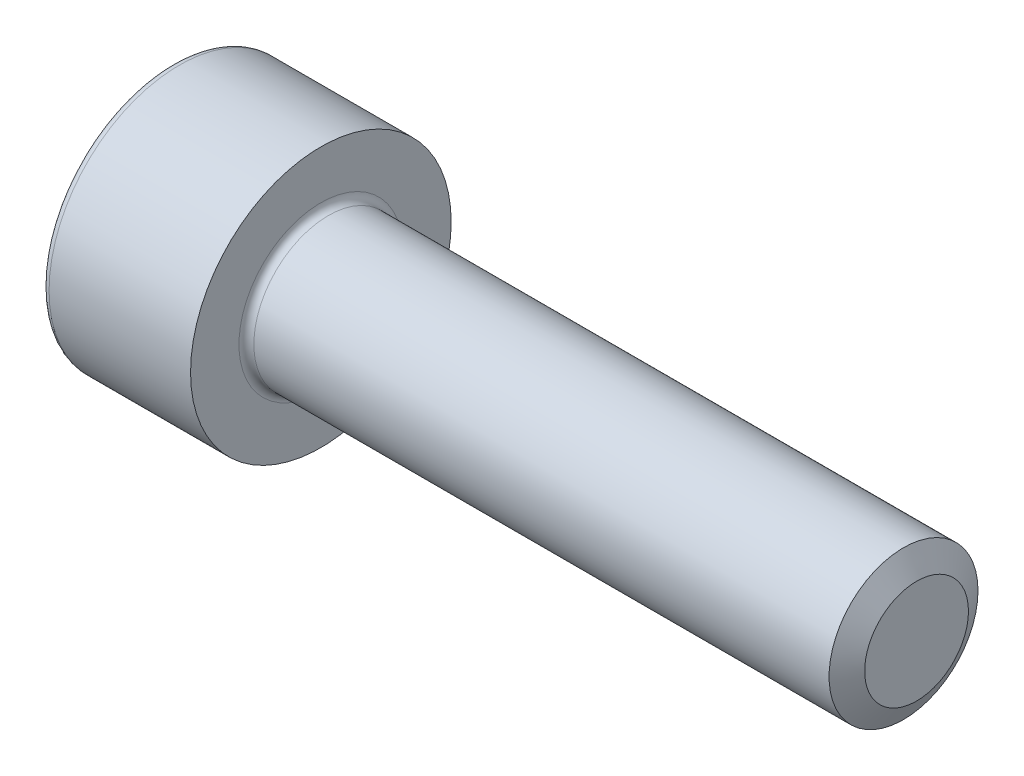
ISO-10303-21;
HEADER;
FILE_DESCRIPTION(('STEP AP214'),'2;1');
FILE_NAME('part.step','',(''),(''),'','','');
FILE_SCHEMA(('AUTOMOTIVE_DESIGN { 1 0 10303 214 1 1 1 1 }'));
ENDSEC;
DATA;
#1=APPLICATION_CONTEXT('core data for automotive mechanical design processes');
#2=APPLICATION_PROTOCOL_DEFINITION('international standard','automotive_design',2000,#1);
#3=PRODUCT_CONTEXT('',#1,'mechanical');
#4=PRODUCT('Part','Part','',(#3));
#5=PRODUCT_RELATED_PRODUCT_CATEGORY('part','',(#4));
#6=PRODUCT_DEFINITION_FORMATION('','',#4);
#7=PRODUCT_DEFINITION_CONTEXT('part definition',#1,'design');
#8=PRODUCT_DEFINITION('design','',#6,#7);
#9=PRODUCT_DEFINITION_SHAPE('','',#8);
#10=(LENGTH_UNIT() NAMED_UNIT(*) SI_UNIT(.MILLI.,.METRE.));
#11=(NAMED_UNIT(*) PLANE_ANGLE_UNIT() SI_UNIT($,.RADIAN.));
#12=(NAMED_UNIT(*) SI_UNIT($,.STERADIAN.) SOLID_ANGLE_UNIT());
#13=UNCERTAINTY_MEASURE_WITH_UNIT(LENGTH_MEASURE(1.E-05),#10,'distance_accuracy_value','');
#14=(GEOMETRIC_REPRESENTATION_CONTEXT(3) GLOBAL_UNCERTAINTY_ASSIGNED_CONTEXT((#13)) GLOBAL_UNIT_ASSIGNED_CONTEXT((#10,
#11,#12)) REPRESENTATION_CONTEXT('',''));
#15=CARTESIAN_POINT('',(0.,0.,0.));
#16=DIRECTION('',(0.,0.,1.));
#17=DIRECTION('',(1.,0.,0.));
#18=AXIS2_PLACEMENT_3D('',#15,#16,#17);
#19=CARTESIAN_POINT('',(0.,0.,0.));
#20=DIRECTION('',(1.,0.,0.));
#21=DIRECTION('',(0.,0.,-1.));
#22=AXIS2_PLACEMENT_3D('',#19,#20,#21);
#23=CYLINDRICAL_SURFACE('',#22,3.5);
#24=CARTESIAN_POINT('',(0.2,0.,0.));
#25=DIRECTION('',(-1.,0.,0.));
#26=DIRECTION('',(0.,0.,1.));
#27=AXIS2_PLACEMENT_3D('',#24,#25,#26);
#28=CIRCLE('',#27,3.5);
#29=CARTESIAN_POINT('',(0.2,0.,3.5));
#30=VERTEX_POINT('',#29);
#31=EDGE_CURVE('E46',#30,#30,#28,.F.);
#32=ORIENTED_EDGE('',*,*,#31,.T.);
#33=EDGE_LOOP('',(#32));
#34=FACE_BOUND('',#33,.T.);
#35=CARTESIAN_POINT('',(4.,0.,0.));
#36=DIRECTION('',(1.,0.,0.));
#37=DIRECTION('',(0.,0.,-1.));
#38=AXIS2_PLACEMENT_3D('',#35,#36,#37);
#39=CIRCLE('',#38,3.5);
#40=CARTESIAN_POINT('',(4.,0.,-3.5));
#41=VERTEX_POINT('',#40);
#42=EDGE_CURVE('E140',#41,#41,#39,.T.);
#43=ORIENTED_EDGE('',*,*,#42,.F.);
#44=EDGE_LOOP('',(#43));
#45=FACE_BOUND('',#44,.T.);
#46=ADVANCED_FACE('F38',(#34,#45),#23,.T.);
#47=CARTESIAN_POINT('',(0.,3.5,0.));
#48=DIRECTION('',(-1.,0.,0.));
#49=DIRECTION('',(0.,0.,1.));
#50=AXIS2_PLACEMENT_3D('',#47,#48,#49);
#51=PLANE('',#50);
#52=CARTESIAN_POINT('',(0.,0.,0.));
#53=DIRECTION('',(-1.,0.,0.));
#54=DIRECTION('',(0.,0.,1.));
#55=AXIS2_PLACEMENT_3D('',#52,#53,#54);
#56=CIRCLE('',#55,3.3);
#57=CARTESIAN_POINT('',(0.,0.,3.3));
#58=VERTEX_POINT('',#57);
#59=EDGE_CURVE('E11',#58,#58,#56,.T.);
#60=ORIENTED_EDGE('',*,*,#59,.T.);
#61=EDGE_LOOP('',(#60));
#62=FACE_BOUND('',#61,.T.);
#63=DIRECTION('',(0.,0.5,-0.866025403784439));
#64=VECTOR('',#63,1.);
#65=CARTESIAN_POINT('',(0.,0.860000000000001,1.48956369450923));
#66=LINE('',#65,#64);
#67=CARTESIAN_POINT('',(0.,0.860000000000001,1.48956369450923));
#68=VERTEX_POINT('',#67);
#69=CARTESIAN_POINT('',(0.,1.72,0.));
#70=VERTEX_POINT('',#69);
#71=EDGE_CURVE('E53',#68,#70,#66,.T.);
#72=ORIENTED_EDGE('',*,*,#71,.F.);
#73=DIRECTION('',(0.,1.,0.));
#74=VECTOR('',#73,1.);
#75=CARTESIAN_POINT('',(0.,-0.86,1.48956369450923));
#76=LINE('',#75,#74);
#77=CARTESIAN_POINT('',(0.,-0.86,1.48956369450923));
#78=VERTEX_POINT('',#77);
#79=EDGE_CURVE('E136',#78,#68,#76,.T.);
#80=ORIENTED_EDGE('',*,*,#79,.F.);
#81=DIRECTION('',(0.,0.5,0.866025403784439));
#82=VECTOR('',#81,1.);
#83=CARTESIAN_POINT('',(0.,-1.72,0.));
#84=LINE('',#83,#82);
#85=CARTESIAN_POINT('',(0.,-1.72,0.));
#86=VERTEX_POINT('',#85);
#87=EDGE_CURVE('E134',#86,#78,#84,.T.);
#88=ORIENTED_EDGE('',*,*,#87,.F.);
#89=DIRECTION('',(0.,-0.5,0.866025403784438));
#90=VECTOR('',#89,1.);
#91=CARTESIAN_POINT('',(0.,-0.86,-1.48956369450923));
#92=LINE('',#91,#90);
#93=CARTESIAN_POINT('',(0.,-0.86,-1.48956369450923));
#94=VERTEX_POINT('',#93);
#95=EDGE_CURVE('E101',#94,#86,#92,.T.);
#96=ORIENTED_EDGE('',*,*,#95,.F.);
#97=DIRECTION('',(0.,-1.,0.));
#98=VECTOR('',#97,1.);
#99=CARTESIAN_POINT('',(0.,0.86,-1.48956369450923));
#100=LINE('',#99,#98);
#101=CARTESIAN_POINT('',(0.,0.86,-1.48956369450923));
#102=VERTEX_POINT('',#101);
#103=EDGE_CURVE('E130',#102,#94,#100,.T.);
#104=ORIENTED_EDGE('',*,*,#103,.F.);
#105=DIRECTION('',(0.,-0.5,-0.866025403784439));
#106=VECTOR('',#105,1.);
#107=CARTESIAN_POINT('',(0.,1.72,0.));
#108=LINE('',#107,#106);
#109=EDGE_CURVE('E127',#70,#102,#108,.T.);
#110=ORIENTED_EDGE('',*,*,#109,.F.);
#111=EDGE_LOOP('',(#72,#80,#88,#96,#104,#110));
#112=FACE_BOUND('',#111,.T.);
#113=ADVANCED_FACE('F174',(#62,#112),#51,.T.);
#114=CARTESIAN_POINT('',(4.,0.,0.));
#115=DIRECTION('',(1.,0.,0.));
#116=DIRECTION('',(0.,0.,-1.));
#117=AXIS2_PLACEMENT_3D('',#114,#115,#116);
#118=PLANE('',#117);
#119=CARTESIAN_POINT('',(4.,0.,0.));
#120=DIRECTION('',(1.,0.,0.));
#121=DIRECTION('',(0.,0.,-1.));
#122=AXIS2_PLACEMENT_3D('',#119,#120,#121);
#123=CIRCLE('',#122,2.2);
#124=CARTESIAN_POINT('',(4.,0.,-2.2));
#125=VERTEX_POINT('',#124);
#126=EDGE_CURVE('E157',#125,#125,#123,.F.);
#127=ORIENTED_EDGE('',*,*,#126,.T.);
#128=EDGE_LOOP('',(#127));
#129=FACE_BOUND('',#128,.T.);
#130=ORIENTED_EDGE('',*,*,#42,.T.);
#131=EDGE_LOOP('',(#130));
#132=FACE_BOUND('',#131,.T.);
#133=ADVANCED_FACE('F179',(#129,#132),#118,.T.);
#134=CARTESIAN_POINT('',(20.,0.,0.));
#135=DIRECTION('',(-1.,0.,0.));
#136=DIRECTION('',(0.,0.,1.));
#137=AXIS2_PLACEMENT_3D('',#134,#135,#136);
#138=CYLINDRICAL_SURFACE('',#137,2.);
#139=CARTESIAN_POINT('',(4.2,0.,0.));
#140=DIRECTION('',(1.,0.,0.));
#141=DIRECTION('',(0.,0.,-1.));
#142=AXIS2_PLACEMENT_3D('',#139,#140,#141);
#143=CIRCLE('',#142,2.);
#144=CARTESIAN_POINT('',(4.2,0.,-2.));
#145=VERTEX_POINT('',#144);
#146=EDGE_CURVE('E154',#145,#145,#143,.T.);
#147=ORIENTED_EDGE('',*,*,#146,.T.);
#148=EDGE_LOOP('',(#147));
#149=FACE_BOUND('',#148,.T.);
#150=CARTESIAN_POINT('',(19.6500000000051,0.,0.));
#151=DIRECTION('',(1.,0.,0.));
#152=DIRECTION('',(0.,0.,-1.));
#153=AXIS2_PLACEMENT_3D('',#150,#151,#152);
#154=CIRCLE('',#153,2.);
#155=CARTESIAN_POINT('',(19.6500000000051,0.,-2.));
#156=VERTEX_POINT('',#155);
#157=EDGE_CURVE('E151',#156,#156,#154,.F.);
#158=ORIENTED_EDGE('',*,*,#157,.T.);
#159=EDGE_LOOP('',(#158));
#160=FACE_BOUND('',#159,.T.);
#161=ADVANCED_FACE('F201',(#149,#160),#138,.T.);
#162=CARTESIAN_POINT('',(20.,0.,0.));
#163=DIRECTION('',(1.,0.,0.));
#164=DIRECTION('',(0.,0.,-1.));
#165=AXIS2_PLACEMENT_3D('',#162,#163,#164);
#166=PLANE('',#165);
#167=CARTESIAN_POINT('',(20.,0.,0.));
#168=DIRECTION('',(1.,0.,0.));
#169=DIRECTION('',(0.,0.,-1.));
#170=AXIS2_PLACEMENT_3D('',#167,#168,#169);
#171=CIRCLE('',#170,1.39380000004541);
#172=CARTESIAN_POINT('',(20.,0.,-1.39380000004541));
#173=VERTEX_POINT('',#172);
#174=EDGE_CURVE('E148',#173,#173,#171,.T.);
#175=ORIENTED_EDGE('',*,*,#174,.T.);
#176=EDGE_LOOP('',(#175));
#177=FACE_BOUND('',#176,.T.);
#178=ADVANCED_FACE('F198',(#177),#166,.T.);
#179=CARTESIAN_POINT('',(2.,0.860000000000001,1.48956369450923));
#180=DIRECTION('',(0.,0.866025403784439,0.5));
#181=DIRECTION('',(0.,-0.5,0.866025403784439));
#182=AXIS2_PLACEMENT_3D('',#179,#180,#181);
#183=PLANE('',#182);
#184=ORIENTED_EDGE('',*,*,#71,.T.);
#185=DIRECTION('',(-1.,0.,0.));
#186=VECTOR('',#185,1.);
#187=CARTESIAN_POINT('',(2.,1.72,0.));
#188=LINE('',#187,#186);
#189=CARTESIAN_POINT('',(2.,1.72,0.));
#190=VERTEX_POINT('',#189);
#191=EDGE_CURVE('E83',#190,#70,#188,.T.);
#192=ORIENTED_EDGE('',*,*,#191,.F.);
#193=DIRECTION('',(0.,0.5,-0.866025403784439));
#194=VECTOR('',#193,1.);
#195=CARTESIAN_POINT('',(2.,0.860000000000001,1.48956369450923));
#196=LINE('',#195,#194);
#197=CARTESIAN_POINT('',(2.,0.860000000000001,1.48956369450923));
#198=VERTEX_POINT('',#197);
#199=EDGE_CURVE('E138',#198,#190,#196,.T.);
#200=ORIENTED_EDGE('',*,*,#199,.F.);
#201=DIRECTION('',(-1.,0.,0.));
#202=VECTOR('',#201,1.);
#203=CARTESIAN_POINT('',(2.,0.860000000000001,1.48956369450923));
#204=LINE('',#203,#202);
#205=EDGE_CURVE('E61',#198,#68,#204,.T.);
#206=ORIENTED_EDGE('',*,*,#205,.T.);
#207=EDGE_LOOP('',(#184,#192,#200,#206));
#208=FACE_BOUND('',#207,.T.);
#209=ADVANCED_FACE('F200',(#208),#183,.F.);
#210=CARTESIAN_POINT('',(2.,-0.86,1.48956369450923));
#211=DIRECTION('',(0.,0.,1.));
#212=DIRECTION('',(0.,-1.,0.));
#213=AXIS2_PLACEMENT_3D('',#210,#211,#212);
#214=PLANE('',#213);
#215=ORIENTED_EDGE('',*,*,#79,.T.);
#216=ORIENTED_EDGE('',*,*,#205,.F.);
#217=DIRECTION('',(0.,1.,0.));
#218=VECTOR('',#217,1.);
#219=CARTESIAN_POINT('',(2.,-0.86,1.48956369450923));
#220=LINE('',#219,#218);
#221=CARTESIAN_POINT('',(2.,-0.86,1.48956369450923));
#222=VERTEX_POINT('',#221);
#223=EDGE_CURVE('E113',#222,#198,#220,.T.);
#224=ORIENTED_EDGE('',*,*,#223,.F.);
#225=DIRECTION('',(-1.,0.,0.));
#226=VECTOR('',#225,1.);
#227=CARTESIAN_POINT('',(2.,-0.86,1.48956369450923));
#228=LINE('',#227,#226);
#229=EDGE_CURVE('E105',#222,#78,#228,.T.);
#230=ORIENTED_EDGE('',*,*,#229,.T.);
#231=EDGE_LOOP('',(#215,#216,#224,#230));
#232=FACE_BOUND('',#231,.T.);
#233=ADVANCED_FACE('F207',(#232),#214,.F.);
#234=CARTESIAN_POINT('',(2.,-1.72,0.));
#235=DIRECTION('',(0.,-0.866025403784439,0.5));
#236=DIRECTION('',(0.,-0.5,-0.866025403784439));
#237=AXIS2_PLACEMENT_3D('',#234,#235,#236);
#238=PLANE('',#237);
#239=ORIENTED_EDGE('',*,*,#87,.T.);
#240=ORIENTED_EDGE('',*,*,#229,.F.);
#241=DIRECTION('',(0.,0.5,0.866025403784439));
#242=VECTOR('',#241,1.);
#243=CARTESIAN_POINT('',(2.,-1.72,0.));
#244=LINE('',#243,#242);
#245=CARTESIAN_POINT('',(2.,-1.72,0.));
#246=VERTEX_POINT('',#245);
#247=EDGE_CURVE('E109',#246,#222,#244,.T.);
#248=ORIENTED_EDGE('',*,*,#247,.F.);
#249=DIRECTION('',(-1.,0.,0.));
#250=VECTOR('',#249,1.);
#251=CARTESIAN_POINT('',(2.,-1.72,0.));
#252=LINE('',#251,#250);
#253=EDGE_CURVE('E94',#246,#86,#252,.T.);
#254=ORIENTED_EDGE('',*,*,#253,.T.);
#255=EDGE_LOOP('',(#239,#240,#248,#254));
#256=FACE_BOUND('',#255,.T.);
#257=ADVANCED_FACE('F110',(#256),#238,.F.);
#258=CARTESIAN_POINT('',(2.,-0.86,-1.48956369450923));
#259=DIRECTION('',(0.,-0.866025403784439,-0.5));
#260=DIRECTION('',(0.,0.5,-0.866025403784438));
#261=AXIS2_PLACEMENT_3D('',#258,#259,#260);
#262=PLANE('',#261);
#263=ORIENTED_EDGE('',*,*,#95,.T.);
#264=ORIENTED_EDGE('',*,*,#253,.F.);
#265=DIRECTION('',(0.,-0.5,0.866025403784438));
#266=VECTOR('',#265,1.);
#267=CARTESIAN_POINT('',(2.,-0.86,-1.48956369450923));
#268=LINE('',#267,#266);
#269=CARTESIAN_POINT('',(2.,-0.86,-1.48956369450923));
#270=VERTEX_POINT('',#269);
#271=EDGE_CURVE('E98',#270,#246,#268,.T.);
#272=ORIENTED_EDGE('',*,*,#271,.F.);
#273=DIRECTION('',(-1.,0.,0.));
#274=VECTOR('',#273,1.);
#275=CARTESIAN_POINT('',(2.,-0.86,-1.48956369450923));
#276=LINE('',#275,#274);
#277=EDGE_CURVE('E106',#270,#94,#276,.T.);
#278=ORIENTED_EDGE('',*,*,#277,.T.);
#279=EDGE_LOOP('',(#263,#264,#272,#278));
#280=FACE_BOUND('',#279,.T.);
#281=ADVANCED_FACE('F96',(#280),#262,.F.);
#282=CARTESIAN_POINT('',(2.,0.86,-1.48956369450923));
#283=DIRECTION('',(0.,0.,-1.));
#284=DIRECTION('',(0.,1.,0.));
#285=AXIS2_PLACEMENT_3D('',#282,#283,#284);
#286=PLANE('',#285);
#287=ORIENTED_EDGE('',*,*,#103,.T.);
#288=ORIENTED_EDGE('',*,*,#277,.F.);
#289=DIRECTION('',(0.,-1.,0.));
#290=VECTOR('',#289,1.);
#291=CARTESIAN_POINT('',(2.,0.86,-1.48956369450923));
#292=LINE('',#291,#290);
#293=CARTESIAN_POINT('',(2.,0.86,-1.48956369450923));
#294=VERTEX_POINT('',#293);
#295=EDGE_CURVE('E119',#294,#270,#292,.T.);
#296=ORIENTED_EDGE('',*,*,#295,.F.);
#297=DIRECTION('',(-1.,0.,0.));
#298=VECTOR('',#297,1.);
#299=CARTESIAN_POINT('',(2.,0.86,-1.48956369450923));
#300=LINE('',#299,#298);
#301=EDGE_CURVE('E143',#294,#102,#300,.T.);
#302=ORIENTED_EDGE('',*,*,#301,.T.);
#303=EDGE_LOOP('',(#287,#288,#296,#302));
#304=FACE_BOUND('',#303,.T.);
#305=ADVANCED_FACE('F258',(#304),#286,.F.);
#306=CARTESIAN_POINT('',(2.,1.72,0.));
#307=DIRECTION('',(0.,0.866025403784439,-0.5));
#308=DIRECTION('',(0.,0.5,0.866025403784439));
#309=AXIS2_PLACEMENT_3D('',#306,#307,#308);
#310=PLANE('',#309);
#311=ORIENTED_EDGE('',*,*,#109,.T.);
#312=ORIENTED_EDGE('',*,*,#301,.F.);
#313=DIRECTION('',(0.,-0.5,-0.866025403784439));
#314=VECTOR('',#313,1.);
#315=CARTESIAN_POINT('',(2.,1.72,0.));
#316=LINE('',#315,#314);
#317=EDGE_CURVE('E121',#190,#294,#316,.T.);
#318=ORIENTED_EDGE('',*,*,#317,.F.);
#319=ORIENTED_EDGE('',*,*,#191,.T.);
#320=EDGE_LOOP('',(#311,#312,#318,#319));
#321=FACE_BOUND('',#320,.T.);
#322=ADVANCED_FACE('F192',(#321),#310,.F.);
#323=CARTESIAN_POINT('',(2.,0.,0.));
#324=DIRECTION('',(-1.,0.,0.));
#325=DIRECTION('',(0.,0.,1.));
#326=AXIS2_PLACEMENT_3D('',#323,#324,#325);
#327=PLANE('',#326);
#328=ORIENTED_EDGE('',*,*,#199,.T.);
#329=ORIENTED_EDGE('',*,*,#317,.T.);
#330=ORIENTED_EDGE('',*,*,#295,.T.);
#331=ORIENTED_EDGE('',*,*,#271,.T.);
#332=ORIENTED_EDGE('',*,*,#247,.T.);
#333=ORIENTED_EDGE('',*,*,#223,.T.);
#334=EDGE_LOOP('',(#328,#329,#330,#331,#332,#333));
#335=FACE_BOUND('',#334,.T.);
#336=ADVANCED_FACE('F116',(#335),#327,.T.);
#337=CARTESIAN_POINT('',(20.,0.,0.));
#338=DIRECTION('',(-1.,0.,0.));
#339=DIRECTION('',(0.,0.,1.));
#340=AXIS2_PLACEMENT_3D('',#337,#338,#339);
#341=CONICAL_SURFACE('',#340,1.39380000004541,1.04718484899879);
#342=ORIENTED_EDGE('',*,*,#157,.F.);
#343=EDGE_LOOP('',(#342));
#344=FACE_BOUND('',#343,.T.);
#345=ORIENTED_EDGE('',*,*,#174,.F.);
#346=EDGE_LOOP('',(#345));
#347=FACE_BOUND('',#346,.T.);
#348=ADVANCED_FACE('F170',(#344,#347),#341,.T.);
#349=CARTESIAN_POINT('',(4.2,0.,0.));
#350=DIRECTION('',(1.,0.,0.));
#351=DIRECTION('',(0.,0.,-1.));
#352=AXIS2_PLACEMENT_3D('',#349,#350,#351);
#353=TOROIDAL_SURFACE('',#352,2.2,0.2);
#354=ORIENTED_EDGE('',*,*,#126,.F.);
#355=EDGE_LOOP('',(#354));
#356=FACE_BOUND('',#355,.T.);
#357=ORIENTED_EDGE('',*,*,#146,.F.);
#358=EDGE_LOOP('',(#357));
#359=FACE_BOUND('',#358,.T.);
#360=ADVANCED_FACE('F165',(#356,#359),#353,.F.);
#361=CARTESIAN_POINT('',(0.2,0.,0.));
#362=DIRECTION('',(-1.,0.,0.));
#363=DIRECTION('',(0.,0.,1.));
#364=AXIS2_PLACEMENT_3D('',#361,#362,#363);
#365=TOROIDAL_SURFACE('',#364,3.3,0.2);
#366=ORIENTED_EDGE('',*,*,#59,.F.);
#367=EDGE_LOOP('',(#366));
#368=FACE_BOUND('',#367,.T.);
#369=ORIENTED_EDGE('',*,*,#31,.F.);
#370=EDGE_LOOP('',(#369));
#371=FACE_BOUND('',#370,.T.);
#372=ADVANCED_FACE('F40',(#368,#371),#365,.T.);
#373=CLOSED_SHELL('',(#46,#113,#133,#161,#178,#209,#233,#257,#281,#305,#322,#336,#348,#360,#372));
#374=MANIFOLD_SOLID_BREP('B2',#373);
#375=ADVANCED_BREP_SHAPE_REPRESENTATION('',(#18,#374),#14);
#376=SHAPE_DEFINITION_REPRESENTATION(#9,#375);
ENDSEC;
END-ISO-10303-21;
